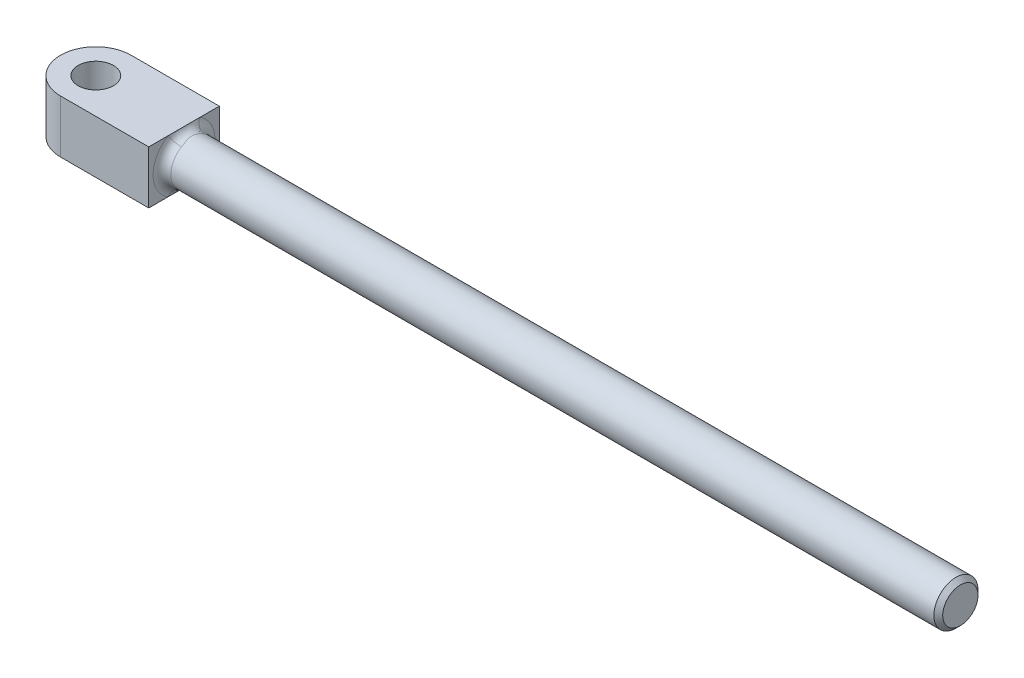
ISO-10303-21;
HEADER;
FILE_DESCRIPTION(('STEP AP214'),'2;1');
FILE_NAME('part.step','',(''),(''),'','','');
FILE_SCHEMA(('AUTOMOTIVE_DESIGN { 1 0 10303 214 1 1 1 1 }'));
ENDSEC;
DATA;
#1=APPLICATION_CONTEXT('core data for automotive mechanical design processes');
#2=APPLICATION_PROTOCOL_DEFINITION('international standard','automotive_design',2000,#1);
#3=PRODUCT_CONTEXT('',#1,'mechanical');
#4=PRODUCT('Part','Part','',(#3));
#5=PRODUCT_RELATED_PRODUCT_CATEGORY('part','',(#4));
#6=PRODUCT_DEFINITION_FORMATION('','',#4);
#7=PRODUCT_DEFINITION_CONTEXT('part definition',#1,'design');
#8=PRODUCT_DEFINITION('design','',#6,#7);
#9=PRODUCT_DEFINITION_SHAPE('','',#8);
#10=(LENGTH_UNIT() NAMED_UNIT(*) SI_UNIT(.MILLI.,.METRE.));
#11=(NAMED_UNIT(*) PLANE_ANGLE_UNIT() SI_UNIT($,.RADIAN.));
#12=(NAMED_UNIT(*) SI_UNIT($,.STERADIAN.) SOLID_ANGLE_UNIT());
#13=UNCERTAINTY_MEASURE_WITH_UNIT(LENGTH_MEASURE(1.E-05),#10,'distance_accuracy_value','');
#14=(GEOMETRIC_REPRESENTATION_CONTEXT(3) GLOBAL_UNCERTAINTY_ASSIGNED_CONTEXT((#13)) GLOBAL_UNIT_ASSIGNED_CONTEXT((#10,
#11,#12)) REPRESENTATION_CONTEXT('',''));
#15=CARTESIAN_POINT('',(0.,0.,0.));
#16=DIRECTION('',(0.,0.,1.));
#17=DIRECTION('',(1.,0.,0.));
#18=AXIS2_PLACEMENT_3D('',#15,#16,#17);
#19=CARTESIAN_POINT('',(-44.,3.,-3.99999999999999));
#20=DIRECTION('',(-1.,0.,0.));
#21=DIRECTION('',(0.,0.,1.));
#22=AXIS2_PLACEMENT_3D('',#19,#20,#21);
#23=PLANE('',#22);
#24=DIRECTION('',(0.,0.,-1.));
#25=VECTOR('',#24,1.);
#26=CARTESIAN_POINT('',(-44.,-3.,-3.99999999999999));
#27=LINE('',#26,#25);
#28=CARTESIAN_POINT('',(-44.,-3.,4.00000000000001));
#29=VERTEX_POINT('',#28);
#30=CARTESIAN_POINT('',(-44.,-3.,1.80277563773199));
#31=VERTEX_POINT('',#30);
#32=EDGE_CURVE('E252',#29,#31,#27,.T.);
#33=ORIENTED_EDGE('',*,*,#32,.T.);
#34=CARTESIAN_POINT('',(-44.,0.,0.));
#35=DIRECTION('',(-1.,0.,0.));
#36=DIRECTION('',(0.,0.,1.));
#37=AXIS2_PLACEMENT_3D('',#34,#35,#36);
#38=CIRCLE('',#37,3.5);
#39=CARTESIAN_POINT('',(-44.,3.,1.80277563773199));
#40=VERTEX_POINT('',#39);
#41=EDGE_CURVE('E69',#31,#40,#38,.T.);
#42=ORIENTED_EDGE('',*,*,#41,.T.);
#43=DIRECTION('',(0.,0.,-1.));
#44=VECTOR('',#43,1.);
#45=CARTESIAN_POINT('',(-44.,3.,-3.99999999999999));
#46=LINE('',#45,#44);
#47=CARTESIAN_POINT('',(-44.,3.,4.00000000000001));
#48=VERTEX_POINT('',#47);
#49=EDGE_CURVE('E122',#48,#40,#46,.T.);
#50=ORIENTED_EDGE('',*,*,#49,.F.);
#51=DIRECTION('',(0.,-1.,0.));
#52=VECTOR('',#51,1.);
#53=CARTESIAN_POINT('',(-44.,3.,4.00000000000001));
#54=LINE('',#53,#52);
#55=EDGE_CURVE('E254',#48,#29,#54,.T.);
#56=ORIENTED_EDGE('',*,*,#55,.T.);
#57=EDGE_LOOP('',(#33,#42,#50,#56));
#58=FACE_BOUND('',#57,.T.);
#59=ADVANCED_FACE('F45',(#58),#23,.F.);
#60=CARTESIAN_POINT('',(44.,0.,0.));
#61=DIRECTION('',(-1.,0.,0.));
#62=DIRECTION('',(0.,0.,1.));
#63=AXIS2_PLACEMENT_3D('',#60,#61,#62);
#64=CYLINDRICAL_SURFACE('',#63,2.5);
#65=CARTESIAN_POINT('',(43.5,0.,0.));
#66=DIRECTION('',(1.,0.,0.));
#67=DIRECTION('',(0.,0.,-1.));
#68=AXIS2_PLACEMENT_3D('',#65,#66,#67);
#69=CIRCLE('',#68,2.5);
#70=CARTESIAN_POINT('',(43.5,0.,-2.5));
#71=VERTEX_POINT('',#70);
#72=EDGE_CURVE('E11',#71,#71,#69,.F.);
#73=ORIENTED_EDGE('',*,*,#72,.T.);
#74=EDGE_LOOP('',(#73));
#75=FACE_BOUND('',#74,.T.);
#76=CARTESIAN_POINT('',(-43.,0.,0.));
#77=DIRECTION('',(-1.,0.,0.));
#78=DIRECTION('',(0.,0.,1.));
#79=AXIS2_PLACEMENT_3D('',#76,#77,#78);
#80=CIRCLE('',#79,2.5);
#81=CARTESIAN_POINT('',(-43.,2.14285714285714,1.28769688409428));
#82=VERTEX_POINT('',#81);
#83=CARTESIAN_POINT('',(-43.,-2.14285714285714,1.28769688409428));
#84=VERTEX_POINT('',#83);
#85=EDGE_CURVE('E138',#82,#84,#80,.F.);
#86=ORIENTED_EDGE('',*,*,#85,.T.);
#87=CARTESIAN_POINT('',(-43.089797118085,-1.84702666727615,1.68478262407076));
#88=CARTESIAN_POINT('',(-44.4013055840775,-2.11805305184009,1.38765648288614));
#89=CARTESIAN_POINT('',(-44.,-3.,2.35869567369906));
#90=CARTESIAN_POINT('',(-43.0750365677151,-1.87021882017818,1.65936827293122));
#91=CARTESIAN_POINT('',(-44.3701378909476,-2.10409965880878,1.39485788528736));
#92=CARTESIAN_POINT('',(-44.,-3.,2.32311558212301));
#93=CARTESIAN_POINT('',(-43.0624960551256,-1.8931706547633,1.63314087938531));
#94=CARTESIAN_POINT('',(-44.3378304890209,-2.09472768310196,1.39873123079868));
#95=CARTESIAN_POINT('',(-44.,-3.,2.28639723116133));
#96=CARTESIAN_POINT('',(-43.0413121648804,-1.93827997476055,1.57933264082472));
#97=CARTESIAN_POINT('',(-44.2739687568214,-2.08398106756867,1.3997411936574));
#98=CARTESIAN_POINT('',(-44.,-3.,2.21106569716945));
#99=CARTESIAN_POINT('',(-43.0326604969719,-1.96043905638494,1.55175481528735));
#100=CARTESIAN_POINT('',(-44.2424003619311,-2.08237228525282,1.39707606759514));
#101=CARTESIAN_POINT('',(-44.,-3.,2.1724567414075));
#102=CARTESIAN_POINT('',(-43.0118107698363,-2.02490711609745,1.46788389797563));
#103=CARTESIAN_POINT('',(-44.153160239198,-2.08663625544711,1.38007393620703));
#104=CARTESIAN_POINT('',(-44.,-3.,2.05503745715557));
#105=CARTESIAN_POINT('',(-43.00440526438,-2.06575259890433,1.40985814870029));
#106=CARTESIAN_POINT('',(-44.0973752365874,-2.10056168474141,1.35734706621003));
#107=CARTESIAN_POINT('',(-44.,-3.,1.97380140817703));
#108=CARTESIAN_POINT('',(-42.996699571837,-2.16653078185199,1.25280520925142));
#109=CARTESIAN_POINT('',(-43.971793247003,-2.1515106641981,1.27354998841386));
#110=CARTESIAN_POINT('',(-44.,-3.,1.75392729295749));
#111=CARTESIAN_POINT('',(-43.0038144970095,-2.22227780908099,1.15097658677616));
#112=CARTESIAN_POINT('',(-43.9094620246063,-2.19733566368004,1.19776380716157));
#113=CARTESIAN_POINT('',(-44.,-3.,1.61136722148821));
#114=CARTESIAN_POINT('',(-43.0285142350657,-2.31925618416504,0.940546919485254));
#115=CARTESIAN_POINT('',(-43.8178292510465,-2.28776397044253,1.01589565420034));
#116=CARTESIAN_POINT('',(-44.,-3.,1.31676568727775));
#117=CARTESIAN_POINT('',(-43.0461778500175,-2.36037452380379,0.831900466571035));
#118=CARTESIAN_POINT('',(-43.7862845207067,-2.3331242401296,0.909812051412252));
#119=CARTESIAN_POINT('',(-44.,-3.,1.1646606531986));
#120=CARTESIAN_POINT('',(-43.0731582535501,-2.41171212801429,0.661443155926707));
#121=CARTESIAN_POINT('',(-43.7528917245329,-2.39215410620666,0.73293320756347));
#122=CARTESIAN_POINT('',(-44.,-3.,0.926020418297847));
#123=CARTESIAN_POINT('',(-43.0825522109005,-2.4274223778965,0.601243759095351));
#124=CARTESIAN_POINT('',(-43.7439634770233,-2.41075944684108,0.66908859746001));
#125=CARTESIAN_POINT('',(-44.,-3.,0.841741262734434));
#126=CARTESIAN_POINT('',(-43.0998403341181,-2.45432605473146,0.479742938974906));
#127=CARTESIAN_POINT('',(-43.7300358645077,-2.44303860810299,0.538014598545595));
#128=CARTESIAN_POINT('',(-44.,-3.,0.671640114565432));
#129=CARTESIAN_POINT('',(-43.1077350515484,-2.46552114449967,0.418441930084296));
#130=CARTESIAN_POINT('',(-43.7249453148161,-2.45686188645873,0.470525326937772));
#131=CARTESIAN_POINT('',(-44.,-3.,0.585818702117714));
#132=CARTESIAN_POINT('',(-43.1207588796569,-2.483274322633,0.295297174727514));
#133=CARTESIAN_POINT('',(-43.7174407917484,-2.47886682684453,0.333738205015885));
#134=CARTESIAN_POINT('',(-44.,-3.,0.41341604461882));
#135=CARTESIAN_POINT('',(-43.1259001064712,-2.48985276592177,0.23345704344554));
#136=CARTESIAN_POINT('',(-43.7149720886307,-2.48717845577119,0.264142380679068));
#137=CARTESIAN_POINT('',(-44.,-3.,0.326839860825512));
#138=CARTESIAN_POINT('',(-43.1326423774325,-2.49838093998099,0.109361414969622));
#139=CARTESIAN_POINT('',(-43.7118654798941,-2.49792896303268,0.124128201815237));
#140=CARTESIAN_POINT('',(-44.,-3.,0.15310598095591));
#141=CARTESIAN_POINT('',(-43.134243770003,-2.50033112630897,0.0471059592608588));
#142=CARTESIAN_POINT('',(-43.7112114325808,-2.5004215525342,0.053369086200987));
#143=CARTESIAN_POINT('',(-44.,-3.,0.0659483429588708));
#144=CARTESIAN_POINT('',(-43.1336139067538,-2.49955575223616,-0.0809249677260376));
#145=CARTESIAN_POINT('',(-43.7114774751147,-2.4994348313836,-0.0917267287856808));
#146=CARTESIAN_POINT('',(-44.,-3.,-0.11329495480976));
#147=CARTESIAN_POINT('',(-43.1311586456095,-2.49655692159848,-0.146698507289059));
#148=CARTESIAN_POINT('',(-43.7124911460776,-2.49560052172953,-0.166438542504345));
#149=CARTESIAN_POINT('',(-44.,-3.,-0.205377910178892));
#150=CARTESIAN_POINT('',(-43.1224512074842,-2.48540146107993,-0.277672408532116));
#151=CARTESIAN_POINT('',(-43.716666788324,-2.48158959625075,-0.313859143066439));
#152=CARTESIAN_POINT('',(-44.,-3.,-0.388741371970758));
#153=CARTESIAN_POINT('',(-43.1161982583954,-2.47724378233976,-0.34287265091976));
#154=CARTESIAN_POINT('',(-43.7198536950069,-2.4713346985524,-0.38696412992512));
#155=CARTESIAN_POINT('',(-44.,-3.,-0.480021711384163));
#156=CARTESIAN_POINT('',(-43.0932464010228,-2.44504355931936,-0.537749623298509));
#157=CARTESIAN_POINT('',(-43.7342534174093,-2.4313991285767,-0.603266803000684));
#158=CARTESIAN_POINT('',(-44.,-3.,-0.752849472792696));
#159=CARTESIAN_POINT('',(-43.0723789849322,-2.4132798538366,-0.665936276663973));
#160=CARTESIAN_POINT('',(-43.7505706277765,-2.39210640783797,-0.742186068976914));
#161=CARTESIAN_POINT('',(-44.,-3.,-0.932310787375736));
#162=CARTESIAN_POINT('',(-43.0325989277867,-2.32918194316109,-0.918065057160651));
#163=CARTESIAN_POINT('',(-43.8098708915164,-2.29892237927612,-0.99519210121178));
#164=CARTESIAN_POINT('',(-44.,-3.,-1.28529107997797));
#165=CARTESIAN_POINT('',(-43.01372459553,-2.27651421506208,-1.04190105099422));
#166=CARTESIAN_POINT('',(-43.8552965844584,-2.24305314597983,-1.1102563906792));
#167=CARTESIAN_POINT('',(-44.,-3.,-1.45866147138323));
#168=CARTESIAN_POINT('',(-43.0006561131893,-2.18316948515407,-1.21991874616669));
#169=CARTESIAN_POINT('',(-43.9527001394436,-2.16884641960792,-1.2448598848791));
#170=CARTESIAN_POINT('',(-44.,-3.,-1.70788624463767));
#171=CARTESIAN_POINT('',(-42.9988115884042,-2.149871023253,-1.27769153842257));
#172=CARTESIAN_POINT('',(-43.9914812930602,-2.145083791615,-1.28423049414726));
#173=CARTESIAN_POINT('',(-44.,-3.,-1.78876815379295));
#174=CARTESIAN_POINT('',(-43.0027809524236,-2.0788450920917,-1.39025899402648));
#175=CARTESIAN_POINT('',(-44.0802128203742,-2.10631330259421,-1.34781643223735));
#176=CARTESIAN_POINT('',(-44.,-3.,-1.94636259163616));
#177=CARTESIAN_POINT('',(-43.0085821638041,-2.04112504867187,-1.445058430778));
#178=CARTESIAN_POINT('',(-44.1308276829839,-2.09160274518386,-1.37150981875896));
#179=CARTESIAN_POINT('',(-44.,-3.,-2.02308180308897));
#180=CARTESIAN_POINT('',(-43.0287135788627,-1.96987321995235,-1.54025161223537));
#181=CARTESIAN_POINT('',(-44.2293462180589,-2.08120077433799,-1.39659640419796));
#182=CARTESIAN_POINT('',(-44.,-3.,-2.1563522571297));
#183=CARTESIAN_POINT('',(-43.0411101719168,-1.93700833370554,-1.58133744408649));
#184=CARTESIAN_POINT('',(-44.2764809877482,-2.08277430752351,-1.40104255573381));
#185=CARTESIAN_POINT('',(-44.,-3.,-2.21387242172118));
#186=CARTESIAN_POINT('',(-43.0748140684746,-1.86941106524606,-1.66075648332885));
#187=CARTESIAN_POINT('',(-44.3718312861369,-2.10297416756328,-1.39609191158888));
#188=CARTESIAN_POINT('',(-44.,-3.,-2.3250590766603));
#189=CARTESIAN_POINT('',(-43.0962198088155,-1.83466186451648,-1.69905362584828));
#190=CARTESIAN_POINT('',(-44.4200246778576,-2.12254536468005,-1.38591811782259));
#191=CARTESIAN_POINT('',(-44.,-3.,-2.37867507618739));
#192=CARTESIAN_POINT('',(-43.1230308972261,-1.7996094539966,-1.73534025859082));
#193=CARTESIAN_POINT('',(-44.4637953692632,-2.1536011914318,-1.36823825990707));
#194=CARTESIAN_POINT('',(-44.,-3.,-2.42947636202715));
#195=(BOUNDED_SURFACE() B_SPLINE_SURFACE(3,2,((#87,#88,#89),(#90,#91,#92),(#93,#94,#95),(#96,
#97,#98),(#99,#100,#101),(#102,#103,#104),(#105,#106,#107),(#108,#109,#110),(#111,#112,#113),
(#114,#115,#116),(#117,#118,#119),(#120,#121,#122),(#123,#124,#125),(#126,#127,#128),(#129,#130,
#131),(#132,#133,#134),(#135,#136,#137),(#138,#139,#140),(#141,#142,#143),(#144,#145,#146),
(#147,#148,#149),(#150,#151,#152),(#153,#154,#155),(#156,#157,#158),(#159,#160,#161),(#162,#163,
#164),(#165,#166,#167),(#168,#169,#170),(#171,#172,#173),(#174,#175,#176),(#177,#178,#179),
(#180,#181,#182),(#183,#184,#185),(#186,#187,#188),(#189,#190,#191),(#192,#193,#194)),
.UNSPECIFIED.,.F.,.F.,.F.) B_SPLINE_SURFACE_WITH_KNOTS((4,2,2,2,2,2,2,2,2,2,2,2,2,2,2,2,2,4),(3,
3),(0.,0.150978452111826,0.301633503365175,0.599468504271149,1.08493079559652,1.5740658222736,
1.83667758241671,2.09919254100669,2.36054266600819,2.62186706535213,2.89810917700128,
3.17440747024342,3.73017973784789,4.29520076320605,4.57485505395894,4.85404623174447,
5.0775082098356,5.30347792971451),(0.,1.),
.UNSPECIFIED.) GEOMETRIC_REPRESENTATION_ITEM() RATIONAL_B_SPLINE_SURFACE(((1.,0.58907223863504,
1.),(1.,0.597621981679868,1.),(1.,0.60628107213765,1.),(1.,0.623622640940449,1.),(1.,
0.632305029457277,1.),(1.,0.657952795370195,1.),(1.,0.674723639585425,1.),(1.,0.716899899837879,
1.),(1.,0.74108911560171,1.),(1.,0.783806931119418,1.),(1.,0.802291321337427,1.),(1.,
0.825548340664816,1.),(1.,0.832706660558894,1.),(1.,0.845003938290569,1.),(1.,0.850143639514369,
1.),(1.,0.858307963303754,1.),(1.,0.861341869719555,1.),(1.,0.865276991795517,1.),(1.,
0.866178417354906,1.),(1.,0.865820137657809,1.),(1.,0.864434126698027,1.),(1.,0.85928990934619,
1.),(1.,0.855531220558888,1.),(1.,0.840741031559036,1.),(1.,0.826198716210334,1.),(1.,
0.788270185201534,1.),(1.,0.764740823018138,1.),(1.,0.724264523444221,1.),(1.,0.709994983454136,
1.),(1.,0.680153160391981,1.),(1.,0.664583073820695,1.),(1.,0.63597985940237,1.),(1.,
0.623060704128204,1.),(1.,0.597254296383171,1.),(1.,0.584369028951347,1.),(1.,0.571874723989392,1.))) REPRESENTATION_ITEM('') SURFACE());
#196=CARTESIAN_POINT('',(-43.089797118085,-1.84702666727615,1.68478262407076));
#197=CARTESIAN_POINT('',(-43.0750365677151,-1.87021882017818,1.65936827293122));
#198=CARTESIAN_POINT('',(-43.0624960551256,-1.8931706547633,1.63314087938531));
#199=CARTESIAN_POINT('',(-43.0413121648804,-1.93827997476055,1.57933264082472));
#200=CARTESIAN_POINT('',(-43.0326604969719,-1.96043905638494,1.55175481528735));
#201=CARTESIAN_POINT('',(-43.0118107698362,-2.02490711609745,1.46788389797563));
#202=CARTESIAN_POINT('',(-43.00440526438,-2.06575259890433,1.40985814870029));
#203=CARTESIAN_POINT('',(-42.996699571837,-2.16653078185199,1.25280520925142));
#204=CARTESIAN_POINT('',(-43.0038144970095,-2.22227780908099,1.15097658677616));
#205=CARTESIAN_POINT('',(-43.0285142350657,-2.31925618416504,0.940546919485254));
#206=CARTESIAN_POINT('',(-43.0461778500175,-2.36037452380379,0.831900466571035));
#207=CARTESIAN_POINT('',(-43.0731582535501,-2.41171212801429,0.661443155926707));
#208=CARTESIAN_POINT('',(-43.0825522109005,-2.4274223778965,0.601243759095351));
#209=CARTESIAN_POINT('',(-43.0998403341181,-2.45432605473146,0.479742938974906));
#210=CARTESIAN_POINT('',(-43.1077350515484,-2.46552114449967,0.418441930084296));
#211=CARTESIAN_POINT('',(-43.1207588796569,-2.483274322633,0.295297174727514));
#212=CARTESIAN_POINT('',(-43.1259001064712,-2.48985276592177,0.23345704344554));
#213=CARTESIAN_POINT('',(-43.1326423774325,-2.49838093998099,0.109361414969622));
#214=CARTESIAN_POINT('',(-43.134243770003,-2.50033112630897,0.0471059592608588));
#215=CARTESIAN_POINT('',(-43.1336139067538,-2.49955575223616,-0.0809249677260375));
#216=CARTESIAN_POINT('',(-43.1311586456095,-2.49655692159848,-0.146698507289059));
#217=CARTESIAN_POINT('',(-43.1224512074842,-2.48540146107993,-0.277672408532116));
#218=CARTESIAN_POINT('',(-43.1161982583954,-2.47724378233976,-0.34287265091976));
#219=CARTESIAN_POINT('',(-43.0932464010228,-2.44504355931936,-0.537749623298509));
#220=CARTESIAN_POINT('',(-43.0723789849322,-2.4132798538366,-0.665936276663973));
#221=CARTESIAN_POINT('',(-43.0325989277867,-2.32918194316109,-0.918065057160651));
#222=CARTESIAN_POINT('',(-43.01372459553,-2.27651421506208,-1.04190105099422));
#223=CARTESIAN_POINT('',(-43.0006561131893,-2.18316948515407,-1.21991874616669));
#224=CARTESIAN_POINT('',(-42.9988115884042,-2.149871023253,-1.27769153842257));
#225=CARTESIAN_POINT('',(-43.0027809524236,-2.0788450920917,-1.39025899402648));
#226=CARTESIAN_POINT('',(-43.0085821638041,-2.04112504867187,-1.445058430778));
#227=CARTESIAN_POINT('',(-43.0287135788627,-1.96987321995235,-1.54025161223537));
#228=CARTESIAN_POINT('',(-43.0411101719168,-1.93700833370554,-1.58133744408649));
#229=CARTESIAN_POINT('',(-43.0748140684746,-1.86941106524606,-1.66075648332885));
#230=CARTESIAN_POINT('',(-43.0962198088155,-1.83466186451648,-1.69905362584828));
#231=CARTESIAN_POINT('',(-43.1230308972261,-1.7996094539966,-1.73534025859082));
#232=B_SPLINE_CURVE_WITH_KNOTS('',3,(#196,#197,#198,#199,#200,#201,#202,#203,#204,#205,#206,
#207,#208,#209,#210,#211,#212,#213,#214,#215,#216,#217,#218,#219,#220,#221,#222,#223,#224,#225,
#226,#227,#228,#229,#230,#231),.UNSPECIFIED.,.F.,.F.,(4,2,2,2,2,2,2,2,2,2,2,2,2,2,2,2,2,4),(0.,
0.150978452111826,0.301633503365175,0.599468504271149,1.08493079559652,1.5740658222736,
1.83667758241671,2.09919254100669,2.36054266600819,2.62186706535213,2.89810917700128,
3.17440747024342,3.73017973784789,4.29520076320605,4.57485505395894,4.85404623174447,
5.0775082098356,5.30347792971451),.UNSPECIFIED.);
#233=CARTESIAN_POINT('',(-43.,-2.14285714285714,-1.28769688409428));
#234=VERTEX_POINT('',#233);
#235=EDGE_CURVE('E198',#84,#234,#232,.T.);
#236=ORIENTED_EDGE('',*,*,#235,.T.);
#237=CARTESIAN_POINT('',(-43.,0.,0.));
#238=DIRECTION('',(-1.,0.,0.));
#239=DIRECTION('',(0.,0.,1.));
#240=AXIS2_PLACEMENT_3D('',#237,#238,#239);
#241=CIRCLE('',#240,2.5);
#242=CARTESIAN_POINT('',(-43.,2.14285714285714,-1.28769688409428));
#243=VERTEX_POINT('',#242);
#244=EDGE_CURVE('E156',#234,#243,#241,.F.);
#245=ORIENTED_EDGE('',*,*,#244,.T.);
#246=CARTESIAN_POINT('',(-43.089797118085,1.84702666727615,-1.68478262407076));
#247=CARTESIAN_POINT('',(-44.4013055840775,2.11805305184009,-1.38765648288614));
#248=CARTESIAN_POINT('',(-44.,3.,-2.35869567369906));
#249=CARTESIAN_POINT('',(-43.0750365677151,1.87021882017818,-1.65936827293122));
#250=CARTESIAN_POINT('',(-44.3701378909476,2.10409965880878,-1.39485788528736));
#251=CARTESIAN_POINT('',(-44.,3.,-2.32311558212301));
#252=CARTESIAN_POINT('',(-43.0624960551256,1.8931706547633,-1.63314087938531));
#253=CARTESIAN_POINT('',(-44.3378304890209,2.09472768310196,-1.39873123079867));
#254=CARTESIAN_POINT('',(-44.,3.,-2.28639723116133));
#255=CARTESIAN_POINT('',(-43.0413121648804,1.93827997476055,-1.57933264082472));
#256=CARTESIAN_POINT('',(-44.2739687568214,2.08398106756867,-1.39974119365739));
#257=CARTESIAN_POINT('',(-44.,3.,-2.21106569716945));
#258=CARTESIAN_POINT('',(-43.0326604969719,1.96043905638494,-1.55175481528735));
#259=CARTESIAN_POINT('',(-44.2424003619311,2.08237228525282,-1.39707606759514));
#260=CARTESIAN_POINT('',(-44.,3.,-2.1724567414075));
#261=CARTESIAN_POINT('',(-43.0118107698363,2.02490711609745,-1.46788389797563));
#262=CARTESIAN_POINT('',(-44.153160239198,2.08663625544711,-1.38007393620703));
#263=CARTESIAN_POINT('',(-44.,3.,-2.05503745715557));
#264=CARTESIAN_POINT('',(-43.00440526438,2.06575259890433,-1.40985814870029));
#265=CARTESIAN_POINT('',(-44.0973752365874,2.10056168474141,-1.35734706621003));
#266=CARTESIAN_POINT('',(-44.,3.,-1.97380140817703));
#267=CARTESIAN_POINT('',(-42.996699571837,2.16653078185199,-1.25280520925142));
#268=CARTESIAN_POINT('',(-43.971793247003,2.1515106641981,-1.27354998841386));
#269=CARTESIAN_POINT('',(-44.,3.,-1.75392729295749));
#270=CARTESIAN_POINT('',(-43.0038144970095,2.22227780908099,-1.15097658677616));
#271=CARTESIAN_POINT('',(-43.9094620246063,2.19733566368004,-1.19776380716157));
#272=CARTESIAN_POINT('',(-44.,3.,-1.61136722148821));
#273=CARTESIAN_POINT('',(-43.0285142350657,2.31925618416504,-0.940546919485254));
#274=CARTESIAN_POINT('',(-43.8178292510465,2.28776397044253,-1.01589565420034));
#275=CARTESIAN_POINT('',(-44.,3.,-1.31676568727775));
#276=CARTESIAN_POINT('',(-43.0461778500175,2.36037452380379,-0.831900466571035));
#277=CARTESIAN_POINT('',(-43.7862845207067,2.3331242401296,-0.909812051412252));
#278=CARTESIAN_POINT('',(-44.,3.,-1.1646606531986));
#279=CARTESIAN_POINT('',(-43.0731582535501,2.41171212801429,-0.661443155926707));
#280=CARTESIAN_POINT('',(-43.7528917245329,2.39215410620666,-0.73293320756347));
#281=CARTESIAN_POINT('',(-44.,3.,-0.926020418297847));
#282=CARTESIAN_POINT('',(-43.0825522109005,2.4274223778965,-0.601243759095351));
#283=CARTESIAN_POINT('',(-43.7439634770233,2.41075944684108,-0.66908859746001));
#284=CARTESIAN_POINT('',(-44.,3.,-0.841741262734434));
#285=CARTESIAN_POINT('',(-43.0998403341181,2.45432605473146,-0.479742938974906));
#286=CARTESIAN_POINT('',(-43.7300358645077,2.44303860810299,-0.538014598545595));
#287=CARTESIAN_POINT('',(-44.,3.,-0.671640114565432));
#288=CARTESIAN_POINT('',(-43.1077350515484,2.46552114449967,-0.418441930084296));
#289=CARTESIAN_POINT('',(-43.7249453148161,2.45686188645873,-0.470525326937772));
#290=CARTESIAN_POINT('',(-44.,3.,-0.585818702117714));
#291=CARTESIAN_POINT('',(-43.1207588796569,2.483274322633,-0.295297174727514));
#292=CARTESIAN_POINT('',(-43.7174407917484,2.47886682684453,-0.333738205015885));
#293=CARTESIAN_POINT('',(-44.,3.,-0.41341604461882));
#294=CARTESIAN_POINT('',(-43.1259001064712,2.48985276592177,-0.23345704344554));
#295=CARTESIAN_POINT('',(-43.7149720886307,2.48717845577119,-0.264142380679068));
#296=CARTESIAN_POINT('',(-44.,3.,-0.326839860825512));
#297=CARTESIAN_POINT('',(-43.1326423774325,2.49838093998099,-0.109361414969622));
#298=CARTESIAN_POINT('',(-43.7118654798941,2.49792896303268,-0.124128201815237));
#299=CARTESIAN_POINT('',(-44.,3.,-0.15310598095591));
#300=CARTESIAN_POINT('',(-43.134243770003,2.50033112630897,-0.0471059592608588));
#301=CARTESIAN_POINT('',(-43.7112114325808,2.5004215525342,-0.053369086200987));
#302=CARTESIAN_POINT('',(-44.,3.,-0.0659483429588708));
#303=CARTESIAN_POINT('',(-43.1336139067538,2.49955575223616,0.0809249677260376));
#304=CARTESIAN_POINT('',(-43.7114774751147,2.4994348313836,0.0917267287856808));
#305=CARTESIAN_POINT('',(-44.,3.,0.11329495480976));
#306=CARTESIAN_POINT('',(-43.1311586456095,2.49655692159848,0.146698507289059));
#307=CARTESIAN_POINT('',(-43.7124911460776,2.49560052172953,0.166438542504345));
#308=CARTESIAN_POINT('',(-44.,3.,0.205377910178892));
#309=CARTESIAN_POINT('',(-43.1224512074842,2.48540146107993,0.277672408532116));
#310=CARTESIAN_POINT('',(-43.716666788324,2.48158959625075,0.313859143066439));
#311=CARTESIAN_POINT('',(-44.,3.,0.388741371970758));
#312=CARTESIAN_POINT('',(-43.1161982583954,2.47724378233976,0.34287265091976));
#313=CARTESIAN_POINT('',(-43.7198536950069,2.4713346985524,0.38696412992512));
#314=CARTESIAN_POINT('',(-44.,3.,0.480021711384163));
#315=CARTESIAN_POINT('',(-43.0932464010228,2.44504355931936,0.537749623298509));
#316=CARTESIAN_POINT('',(-43.7342534174093,2.4313991285767,0.603266803000684));
#317=CARTESIAN_POINT('',(-44.,3.,0.752849472792696));
#318=CARTESIAN_POINT('',(-43.0723789849322,2.4132798538366,0.665936276663973));
#319=CARTESIAN_POINT('',(-43.7505706277765,2.39210640783797,0.742186068976914));
#320=CARTESIAN_POINT('',(-44.,3.,0.932310787375736));
#321=CARTESIAN_POINT('',(-43.0325989277867,2.32918194316109,0.918065057160651));
#322=CARTESIAN_POINT('',(-43.8098708915164,2.29892237927612,0.99519210121178));
#323=CARTESIAN_POINT('',(-44.,3.,1.28529107997797));
#324=CARTESIAN_POINT('',(-43.01372459553,2.27651421506208,1.04190105099422));
#325=CARTESIAN_POINT('',(-43.8552965844584,2.24305314597983,1.1102563906792));
#326=CARTESIAN_POINT('',(-44.,3.,1.45866147138323));
#327=CARTESIAN_POINT('',(-43.0006561131893,2.18316948515407,1.21991874616669));
#328=CARTESIAN_POINT('',(-43.9527001394436,2.16884641960792,1.2448598848791));
#329=CARTESIAN_POINT('',(-44.,3.,1.70788624463767));
#330=CARTESIAN_POINT('',(-42.9988115884042,2.149871023253,1.27769153842257));
#331=CARTESIAN_POINT('',(-43.9914812930602,2.145083791615,1.28423049414726));
#332=CARTESIAN_POINT('',(-44.,3.,1.78876815379295));
#333=CARTESIAN_POINT('',(-43.0027809524236,2.0788450920917,1.39025899402648));
#334=CARTESIAN_POINT('',(-44.0802128203742,2.10631330259421,1.34781643223736));
#335=CARTESIAN_POINT('',(-44.,3.,1.94636259163616));
#336=CARTESIAN_POINT('',(-43.0085821638041,2.04112504867187,1.445058430778));
#337=CARTESIAN_POINT('',(-44.1308276829839,2.09160274518386,1.37150981875896));
#338=CARTESIAN_POINT('',(-44.,3.,2.02308180308897));
#339=CARTESIAN_POINT('',(-43.0287135788627,1.96987321995235,1.54025161223537));
#340=CARTESIAN_POINT('',(-44.2293462180589,2.08120077433799,1.39659640419796));
#341=CARTESIAN_POINT('',(-44.,3.,2.1563522571297));
#342=CARTESIAN_POINT('',(-43.0411101719168,1.93700833370554,1.58133744408649));
#343=CARTESIAN_POINT('',(-44.2764809877482,2.08277430752351,1.40104255573381));
#344=CARTESIAN_POINT('',(-44.,3.,2.21387242172117));
#345=CARTESIAN_POINT('',(-43.0748140684746,1.86941106524606,1.66075648332885));
#346=CARTESIAN_POINT('',(-44.3718312861369,2.10297416756328,1.39609191158888));
#347=CARTESIAN_POINT('',(-44.,3.,2.3250590766603));
#348=CARTESIAN_POINT('',(-43.0962198088155,1.83466186451648,1.69905362584828));
#349=CARTESIAN_POINT('',(-44.4200246778576,2.12254536468005,1.38591811782259));
#350=CARTESIAN_POINT('',(-44.,3.,2.37867507618739));
#351=CARTESIAN_POINT('',(-43.1230308972261,1.7996094539966,1.73534025859082));
#352=CARTESIAN_POINT('',(-44.4637953692632,2.1536011914318,1.36823825990707));
#353=CARTESIAN_POINT('',(-44.,3.,2.42947636202715));
#354=(BOUNDED_SURFACE() B_SPLINE_SURFACE(3,2,((#246,#247,#248),(#249,#250,#251),(#252,#253,
#254),(#255,#256,#257),(#258,#259,#260),(#261,#262,#263),(#264,#265,#266),(#267,#268,#269),
(#270,#271,#272),(#273,#274,#275),(#276,#277,#278),(#279,#280,#281),(#282,#283,#284),(#285,#286,
#287),(#288,#289,#290),(#291,#292,#293),(#294,#295,#296),(#297,#298,#299),(#300,#301,#302),
(#303,#304,#305),(#306,#307,#308),(#309,#310,#311),(#312,#313,#314),(#315,#316,#317),(#318,#319,
#320),(#321,#322,#323),(#324,#325,#326),(#327,#328,#329),(#330,#331,#332),(#333,#334,#335),
(#336,#337,#338),(#339,#340,#341),(#342,#343,#344),(#345,#346,#347),(#348,#349,#350),(#351,#352,
#353)),.UNSPECIFIED.,.F.,.F.,.F.) B_SPLINE_SURFACE_WITH_KNOTS((4,2,2,2,2,2,2,2,2,2,2,2,2,2,2,2,
2,4),(3,3),(0.,0.150978452111826,0.301633503365175,0.599468504271149,1.08493079559652,
1.5740658222736,1.83667758241671,2.09919254100669,2.36054266600819,2.62186706535213,
2.89810917700128,3.17440747024342,3.73017973784789,4.29520076320605,4.57485505395894,
4.85404623174447,5.0775082098356,5.30347792971451),(0.,1.),
.UNSPECIFIED.) GEOMETRIC_REPRESENTATION_ITEM() RATIONAL_B_SPLINE_SURFACE(((1.,0.58907223863504,
1.),(1.,0.597621981679868,1.),(1.,0.60628107213765,1.),(1.,0.62362264094045,1.),(1.,
0.632305029457277,1.),(1.,0.657952795370195,1.),(1.,0.674723639585425,1.),(1.,0.716899899837879,
1.),(1.,0.74108911560171,1.),(1.,0.783806931119418,1.),(1.,0.802291321337427,1.),(1.,
0.825548340664816,1.),(1.,0.832706660558894,1.),(1.,0.845003938290569,1.),(1.,0.850143639514369,
1.),(1.,0.858307963303754,1.),(1.,0.861341869719555,1.),(1.,0.865276991795517,1.),(1.,
0.866178417354906,1.),(1.,0.865820137657809,1.),(1.,0.864434126698027,1.),(1.,0.85928990934619,
1.),(1.,0.855531220558888,1.),(1.,0.840741031559036,1.),(1.,0.826198716210334,1.),(1.,
0.788270185201534,1.),(1.,0.764740823018138,1.),(1.,0.724264523444221,1.),(1.,0.709994983454136,
1.),(1.,0.680153160391981,1.),(1.,0.664583073820695,1.),(1.,0.635979859402369,1.),(1.,
0.623060704128204,1.),(1.,0.597254296383171,1.),(1.,0.584369028951347,1.),(1.,0.571874723989392,1.))) REPRESENTATION_ITEM('') SURFACE());
#355=CARTESIAN_POINT('',(-43.089797118085,1.84702666727615,-1.68478262407076));
#356=CARTESIAN_POINT('',(-43.0750365677151,1.87021882017818,-1.65936827293122));
#357=CARTESIAN_POINT('',(-43.0624960551256,1.8931706547633,-1.63314087938531));
#358=CARTESIAN_POINT('',(-43.0413121648804,1.93827997476055,-1.57933264082472));
#359=CARTESIAN_POINT('',(-43.0326604969719,1.96043905638494,-1.55175481528735));
#360=CARTESIAN_POINT('',(-43.0118107698362,2.02490711609745,-1.46788389797563));
#361=CARTESIAN_POINT('',(-43.00440526438,2.06575259890433,-1.40985814870029));
#362=CARTESIAN_POINT('',(-42.996699571837,2.16653078185199,-1.25280520925142));
#363=CARTESIAN_POINT('',(-43.0038144970095,2.22227780908099,-1.15097658677616));
#364=CARTESIAN_POINT('',(-43.0285142350657,2.31925618416504,-0.940546919485254));
#365=CARTESIAN_POINT('',(-43.0461778500175,2.36037452380379,-0.831900466571035));
#366=CARTESIAN_POINT('',(-43.0731582535501,2.41171212801429,-0.661443155926707));
#367=CARTESIAN_POINT('',(-43.0825522109005,2.4274223778965,-0.601243759095351));
#368=CARTESIAN_POINT('',(-43.0998403341181,2.45432605473146,-0.479742938974906));
#369=CARTESIAN_POINT('',(-43.1077350515484,2.46552114449967,-0.418441930084296));
#370=CARTESIAN_POINT('',(-43.1207588796569,2.483274322633,-0.295297174727514));
#371=CARTESIAN_POINT('',(-43.1259001064712,2.48985276592177,-0.23345704344554));
#372=CARTESIAN_POINT('',(-43.1326423774325,2.49838093998099,-0.109361414969622));
#373=CARTESIAN_POINT('',(-43.134243770003,2.50033112630897,-0.0471059592608588));
#374=CARTESIAN_POINT('',(-43.1336139067538,2.49955575223616,0.0809249677260375));
#375=CARTESIAN_POINT('',(-43.1311586456095,2.49655692159848,0.146698507289059));
#376=CARTESIAN_POINT('',(-43.1224512074842,2.48540146107993,0.277672408532116));
#377=CARTESIAN_POINT('',(-43.1161982583954,2.47724378233976,0.34287265091976));
#378=CARTESIAN_POINT('',(-43.0932464010228,2.44504355931936,0.537749623298509));
#379=CARTESIAN_POINT('',(-43.0723789849322,2.4132798538366,0.665936276663973));
#380=CARTESIAN_POINT('',(-43.0325989277867,2.32918194316109,0.918065057160651));
#381=CARTESIAN_POINT('',(-43.01372459553,2.27651421506208,1.04190105099422));
#382=CARTESIAN_POINT('',(-43.0006561131893,2.18316948515407,1.21991874616669));
#383=CARTESIAN_POINT('',(-42.9988115884042,2.149871023253,1.27769153842257));
#384=CARTESIAN_POINT('',(-43.0027809524236,2.0788450920917,1.39025899402648));
#385=CARTESIAN_POINT('',(-43.0085821638041,2.04112504867187,1.445058430778));
#386=CARTESIAN_POINT('',(-43.0287135788627,1.96987321995235,1.54025161223537));
#387=CARTESIAN_POINT('',(-43.0411101719168,1.93700833370554,1.58133744408649));
#388=CARTESIAN_POINT('',(-43.0748140684746,1.86941106524606,1.66075648332885));
#389=CARTESIAN_POINT('',(-43.0962198088155,1.83466186451648,1.69905362584828));
#390=CARTESIAN_POINT('',(-43.1230308972261,1.7996094539966,1.73534025859082));
#391=B_SPLINE_CURVE_WITH_KNOTS('',3,(#355,#356,#357,#358,#359,#360,#361,#362,#363,#364,#365,
#366,#367,#368,#369,#370,#371,#372,#373,#374,#375,#376,#377,#378,#379,#380,#381,#382,#383,#384,
#385,#386,#387,#388,#389,#390),.UNSPECIFIED.,.F.,.F.,(4,2,2,2,2,2,2,2,2,2,2,2,2,2,2,2,2,4),(0.,
0.150978452111826,0.301633503365175,0.599468504271149,1.08493079559652,1.5740658222736,
1.83667758241671,2.09919254100669,2.36054266600819,2.62186706535213,2.89810917700128,
3.17440747024342,3.73017973784789,4.29520076320605,4.57485505395894,4.85404623174447,
5.0775082098356,5.30347792971451),.UNSPECIFIED.);
#392=EDGE_CURVE('E142',#243,#82,#391,.T.);
#393=ORIENTED_EDGE('',*,*,#392,.T.);
#394=EDGE_LOOP('',(#86,#236,#245,#393));
#395=FACE_BOUND('',#394,.T.);
#396=ADVANCED_FACE('F158',(#75,#395),#64,.T.);
#397=CARTESIAN_POINT('',(44.,0.,0.));
#398=DIRECTION('',(1.,0.,0.));
#399=DIRECTION('',(0.,0.,-1.));
#400=AXIS2_PLACEMENT_3D('',#397,#398,#399);
#401=PLANE('',#400);
#402=CARTESIAN_POINT('',(44.,0.,0.));
#403=DIRECTION('',(1.,0.,0.));
#404=DIRECTION('',(0.,0.,-1.));
#405=AXIS2_PLACEMENT_3D('',#402,#403,#404);
#406=CIRCLE('',#405,2.);
#407=CARTESIAN_POINT('',(44.,0.,-2.));
#408=VERTEX_POINT('',#407);
#409=EDGE_CURVE('E54',#408,#408,#406,.T.);
#410=ORIENTED_EDGE('',*,*,#409,.T.);
#411=EDGE_LOOP('',(#410));
#412=FACE_BOUND('',#411,.T.);
#413=ADVANCED_FACE('F248',(#412),#401,.T.);
#414=CARTESIAN_POINT('',(-54.,3.,0.));
#415=DIRECTION('',(0.,1.,0.));
#416=DIRECTION('',(0.,0.,1.));
#417=AXIS2_PLACEMENT_3D('',#414,#415,#416);
#418=PLANE('',#417);
#419=ORIENTED_EDGE('',*,*,#49,.T.);
#420=CARTESIAN_POINT('',(-44.,3.,-1.80277563773199));
#421=VERTEX_POINT('',#420);
#422=EDGE_CURVE('E117',#40,#421,#46,.T.);
#423=ORIENTED_EDGE('',*,*,#422,.T.);
#424=CARTESIAN_POINT('',(-44.,3.,-3.99999999999999));
#425=VERTEX_POINT('',#424);
#426=EDGE_CURVE('E61',#421,#425,#46,.T.);
#427=ORIENTED_EDGE('',*,*,#426,.T.);
#428=DIRECTION('',(-1.,0.,0.));
#429=VECTOR('',#428,1.);
#430=CARTESIAN_POINT('',(-44.,3.,-3.99999999999999));
#431=LINE('',#430,#429);
#432=CARTESIAN_POINT('',(-54.,3.,-3.99999999999999));
#433=VERTEX_POINT('',#432);
#434=EDGE_CURVE('E114',#425,#433,#431,.T.);
#435=ORIENTED_EDGE('',*,*,#434,.T.);
#436=CARTESIAN_POINT('',(-54.,3.,0.));
#437=DIRECTION('',(0.,1.,0.));
#438=DIRECTION('',(0.,0.,1.));
#439=AXIS2_PLACEMENT_3D('',#436,#437,#438);
#440=CIRCLE('',#439,4.);
#441=CARTESIAN_POINT('',(-54.,3.,4.00000000000001));
#442=VERTEX_POINT('',#441);
#443=EDGE_CURVE('E131',#433,#442,#440,.T.);
#444=ORIENTED_EDGE('',*,*,#443,.T.);
#445=DIRECTION('',(1.,0.,0.));
#446=VECTOR('',#445,1.);
#447=CARTESIAN_POINT('',(-44.,3.,4.00000000000001));
#448=LINE('',#447,#446);
#449=EDGE_CURVE('E282',#442,#48,#448,.T.);
#450=ORIENTED_EDGE('',*,*,#449,.T.);
#451=EDGE_LOOP('',(#419,#423,#427,#435,#444,#450));
#452=FACE_BOUND('',#451,.T.);
#453=CARTESIAN_POINT('',(-54.,3.,0.));
#454=DIRECTION('',(0.,1.,0.));
#455=DIRECTION('',(0.,0.,1.));
#456=AXIS2_PLACEMENT_3D('',#453,#454,#455);
#457=CIRCLE('',#456,2.);
#458=CARTESIAN_POINT('',(-54.,3.,2.00000000000001));
#459=VERTEX_POINT('',#458);
#460=EDGE_CURVE('E268',#459,#459,#457,.T.);
#461=ORIENTED_EDGE('',*,*,#460,.F.);
#462=EDGE_LOOP('',(#461));
#463=FACE_BOUND('',#462,.T.);
#464=ADVANCED_FACE('F112',(#452,#463),#418,.T.);
#465=CARTESIAN_POINT('',(-54.,-3.,0.));
#466=DIRECTION('',(0.,1.,0.));
#467=DIRECTION('',(0.,0.,1.));
#468=AXIS2_PLACEMENT_3D('',#465,#466,#467);
#469=PLANE('',#468);
#470=ORIENTED_EDGE('',*,*,#32,.F.);
#471=DIRECTION('',(1.,0.,0.));
#472=VECTOR('',#471,1.);
#473=CARTESIAN_POINT('',(-44.,-3.,4.00000000000001));
#474=LINE('',#473,#472);
#475=CARTESIAN_POINT('',(-54.,-3.,4.00000000000001));
#476=VERTEX_POINT('',#475);
#477=EDGE_CURVE('E120',#476,#29,#474,.T.);
#478=ORIENTED_EDGE('',*,*,#477,.F.);
#479=CARTESIAN_POINT('',(-54.,-3.,0.));
#480=DIRECTION('',(0.,1.,0.));
#481=DIRECTION('',(0.,0.,1.));
#482=AXIS2_PLACEMENT_3D('',#479,#480,#481);
#483=CIRCLE('',#482,4.);
#484=CARTESIAN_POINT('',(-54.,-3.,-3.99999999999999));
#485=VERTEX_POINT('',#484);
#486=EDGE_CURVE('E263',#485,#476,#483,.T.);
#487=ORIENTED_EDGE('',*,*,#486,.F.);
#488=DIRECTION('',(-1.,0.,0.));
#489=VECTOR('',#488,1.);
#490=CARTESIAN_POINT('',(-44.,-3.,-3.99999999999999));
#491=LINE('',#490,#489);
#492=CARTESIAN_POINT('',(-44.,-3.,-3.99999999999999));
#493=VERTEX_POINT('',#492);
#494=EDGE_CURVE('E258',#493,#485,#491,.T.);
#495=ORIENTED_EDGE('',*,*,#494,.F.);
#496=CARTESIAN_POINT('',(-44.,-3.,-1.80277563773199));
#497=VERTEX_POINT('',#496);
#498=EDGE_CURVE('E135',#497,#493,#27,.T.);
#499=ORIENTED_EDGE('',*,*,#498,.F.);
#500=EDGE_CURVE('E259',#31,#497,#27,.T.);
#501=ORIENTED_EDGE('',*,*,#500,.F.);
#502=EDGE_LOOP('',(#470,#478,#487,#495,#499,#501));
#503=FACE_BOUND('',#502,.T.);
#504=CARTESIAN_POINT('',(-54.,-3.,0.));
#505=DIRECTION('',(0.,1.,0.));
#506=DIRECTION('',(0.,0.,1.));
#507=AXIS2_PLACEMENT_3D('',#504,#505,#506);
#508=CIRCLE('',#507,2.);
#509=CARTESIAN_POINT('',(-54.,-3.,2.00000000000001));
#510=VERTEX_POINT('',#509);
#511=EDGE_CURVE('E271',#510,#510,#508,.T.);
#512=ORIENTED_EDGE('',*,*,#511,.T.);
#513=EDGE_LOOP('',(#512));
#514=FACE_BOUND('',#513,.T.);
#515=ADVANCED_FACE('F226',(#503,#514),#469,.F.);
#516=ORIENTED_EDGE('',*,*,#426,.F.);
#517=CARTESIAN_POINT('',(-44.,0.,0.));
#518=DIRECTION('',(-1.,0.,0.));
#519=DIRECTION('',(0.,0.,1.));
#520=AXIS2_PLACEMENT_3D('',#517,#518,#519);
#521=CIRCLE('',#520,3.5);
#522=EDGE_CURVE('E195',#421,#497,#521,.T.);
#523=ORIENTED_EDGE('',*,*,#522,.T.);
#524=ORIENTED_EDGE('',*,*,#498,.T.);
#525=DIRECTION('',(0.,-1.,0.));
#526=VECTOR('',#525,1.);
#527=CARTESIAN_POINT('',(-44.,3.,-3.99999999999999));
#528=LINE('',#527,#526);
#529=EDGE_CURVE('E126',#425,#493,#528,.T.);
#530=ORIENTED_EDGE('',*,*,#529,.F.);
#531=EDGE_LOOP('',(#516,#523,#524,#530));
#532=FACE_BOUND('',#531,.T.);
#533=ADVANCED_FACE('F133',(#532),#23,.F.);
#534=CARTESIAN_POINT('',(-44.,3.,-3.99999999999999));
#535=DIRECTION('',(0.,0.,1.));
#536=DIRECTION('',(1.,0.,0.));
#537=AXIS2_PLACEMENT_3D('',#534,#535,#536);
#538=PLANE('',#537);
#539=ORIENTED_EDGE('',*,*,#494,.T.);
#540=DIRECTION('',(0.,-1.,0.));
#541=VECTOR('',#540,1.);
#542=CARTESIAN_POINT('',(-54.,3.,-3.99999999999999));
#543=LINE('',#542,#541);
#544=EDGE_CURVE('E128',#433,#485,#543,.T.);
#545=ORIENTED_EDGE('',*,*,#544,.F.);
#546=ORIENTED_EDGE('',*,*,#434,.F.);
#547=ORIENTED_EDGE('',*,*,#529,.T.);
#548=EDGE_LOOP('',(#539,#545,#546,#547));
#549=FACE_BOUND('',#548,.T.);
#550=ADVANCED_FACE('F125',(#549),#538,.F.);
#551=CARTESIAN_POINT('',(-54.,3.,0.));
#552=DIRECTION('',(0.,-1.,0.));
#553=DIRECTION('',(0.,0.,-1.));
#554=AXIS2_PLACEMENT_3D('',#551,#552,#553);
#555=CYLINDRICAL_SURFACE('',#554,4.);
#556=ORIENTED_EDGE('',*,*,#486,.T.);
#557=DIRECTION('',(0.,-1.,0.));
#558=VECTOR('',#557,1.);
#559=CARTESIAN_POINT('',(-54.,3.,4.00000000000001));
#560=LINE('',#559,#558);
#561=EDGE_CURVE('E144',#442,#476,#560,.T.);
#562=ORIENTED_EDGE('',*,*,#561,.F.);
#563=ORIENTED_EDGE('',*,*,#443,.F.);
#564=ORIENTED_EDGE('',*,*,#544,.T.);
#565=EDGE_LOOP('',(#556,#562,#563,#564));
#566=FACE_BOUND('',#565,.T.);
#567=ADVANCED_FACE('F236',(#566),#555,.T.);
#568=CARTESIAN_POINT('',(-44.,3.,4.00000000000001));
#569=DIRECTION('',(0.,0.,-1.));
#570=DIRECTION('',(-1.,0.,0.));
#571=AXIS2_PLACEMENT_3D('',#568,#569,#570);
#572=PLANE('',#571);
#573=ORIENTED_EDGE('',*,*,#477,.T.);
#574=ORIENTED_EDGE('',*,*,#55,.F.);
#575=ORIENTED_EDGE('',*,*,#449,.F.);
#576=ORIENTED_EDGE('',*,*,#561,.T.);
#577=EDGE_LOOP('',(#573,#574,#575,#576));
#578=FACE_BOUND('',#577,.T.);
#579=ADVANCED_FACE('F233',(#578),#572,.F.);
#580=CARTESIAN_POINT('',(-54.,3.,0.));
#581=DIRECTION('',(0.,-1.,0.));
#582=DIRECTION('',(0.,0.,-1.));
#583=AXIS2_PLACEMENT_3D('',#580,#581,#582);
#584=CYLINDRICAL_SURFACE('',#583,2.);
#585=ORIENTED_EDGE('',*,*,#460,.T.);
#586=EDGE_LOOP('',(#585));
#587=FACE_BOUND('',#586,.T.);
#588=ORIENTED_EDGE('',*,*,#511,.F.);
#589=EDGE_LOOP('',(#588));
#590=FACE_BOUND('',#589,.T.);
#591=ADVANCED_FACE('F173',(#587,#590),#584,.F.);
#592=CARTESIAN_POINT('',(-43.,3.,-1.80277563773199));
#593=DIRECTION('',(0.,-0.515078753637713,-0.857142857142857));
#594=DIRECTION('',(0.,0.857142857142857,-0.515078753637713));
#595=AXIS2_PLACEMENT_3D('',#592,#593,#594);
#596=CIRCLE('',#595,1.);
#597=EDGE_CURVE('E207',#421,#243,#596,.F.);
#598=ORIENTED_EDGE('',*,*,#597,.F.);
#599=ORIENTED_EDGE('',*,*,#422,.F.);
#600=CARTESIAN_POINT('',(-43.,3.00000000000052,1.80277563773113));
#601=DIRECTION('',(-2.68055761773535E-13,0.515078753637465,-0.857142857143006));
#602=DIRECTION('',(0.,0.857142857143006,0.515078753637465));
#603=AXIS2_PLACEMENT_3D('',#600,#601,#602);
#604=CIRCLE('',#603,1.);
#605=EDGE_CURVE('E277',#82,#40,#604,.T.);
#606=ORIENTED_EDGE('',*,*,#605,.F.);
#607=ORIENTED_EDGE('',*,*,#392,.F.);
#608=EDGE_LOOP('',(#598,#599,#606,#607));
#609=FACE_BOUND('',#608,.T.);
#610=ADVANCED_FACE('F166',(#609),#354,.F.);
#611=CARTESIAN_POINT('',(-43.,0.,0.));
#612=DIRECTION('',(-1.,0.,0.));
#613=DIRECTION('',(0.,0.,1.));
#614=AXIS2_PLACEMENT_3D('',#611,#612,#613);
#615=TOROIDAL_SURFACE('',#614,3.5,1.);
#616=ORIENTED_EDGE('',*,*,#605,.T.);
#617=ORIENTED_EDGE('',*,*,#41,.F.);
#618=CARTESIAN_POINT('',(-43.,-3.,1.80277563773199));
#619=DIRECTION('',(0.,0.515078753637712,0.857142857142857));
#620=DIRECTION('',(0.,-0.857142857142857,0.515078753637713));
#621=AXIS2_PLACEMENT_3D('',#618,#619,#620);
#622=CIRCLE('',#621,1.);
#623=EDGE_CURVE('E204',#84,#31,#622,.T.);
#624=ORIENTED_EDGE('',*,*,#623,.F.);
#625=ORIENTED_EDGE('',*,*,#85,.F.);
#626=EDGE_LOOP('',(#616,#617,#624,#625));
#627=FACE_BOUND('',#626,.T.);
#628=ADVANCED_FACE('F172',(#627),#615,.F.);
#629=CARTESIAN_POINT('',(-43.,0.,0.));
#630=DIRECTION('',(-1.,0.,0.));
#631=DIRECTION('',(0.,0.,1.));
#632=AXIS2_PLACEMENT_3D('',#629,#630,#631);
#633=TOROIDAL_SURFACE('',#632,3.5,1.);
#634=ORIENTED_EDGE('',*,*,#597,.T.);
#635=ORIENTED_EDGE('',*,*,#244,.F.);
#636=CARTESIAN_POINT('',(-43.,-3.,-1.80277563773199));
#637=DIRECTION('',(0.,0.515078753637712,-0.857142857142857));
#638=DIRECTION('',(0.,0.857142857142857,0.515078753637713));
#639=AXIS2_PLACEMENT_3D('',#636,#637,#638);
#640=CIRCLE('',#639,1.);
#641=EDGE_CURVE('E201',#497,#234,#640,.T.);
#642=ORIENTED_EDGE('',*,*,#641,.F.);
#643=ORIENTED_EDGE('',*,*,#522,.F.);
#644=EDGE_LOOP('',(#634,#635,#642,#643));
#645=FACE_BOUND('',#644,.T.);
#646=ADVANCED_FACE('F314',(#645),#633,.F.);
#647=ORIENTED_EDGE('',*,*,#623,.T.);
#648=ORIENTED_EDGE('',*,*,#500,.T.);
#649=ORIENTED_EDGE('',*,*,#641,.T.);
#650=ORIENTED_EDGE('',*,*,#235,.F.);
#651=EDGE_LOOP('',(#647,#648,#649,#650));
#652=FACE_BOUND('',#651,.T.);
#653=ADVANCED_FACE('F221',(#652),#195,.F.);
#654=CARTESIAN_POINT('',(44.,0.,0.));
#655=DIRECTION('',(-1.,0.,0.));
#656=DIRECTION('',(0.,0.,1.));
#657=AXIS2_PLACEMENT_3D('',#654,#655,#656);
#658=CONICAL_SURFACE('',#657,2.,0.785398163397453);
#659=ORIENTED_EDGE('',*,*,#72,.F.);
#660=EDGE_LOOP('',(#659));
#661=FACE_BOUND('',#660,.T.);
#662=ORIENTED_EDGE('',*,*,#409,.F.);
#663=EDGE_LOOP('',(#662));
#664=FACE_BOUND('',#663,.T.);
#665=ADVANCED_FACE('F47',(#661,#664),#658,.T.);
#666=CLOSED_SHELL('',(#59,#396,#413,#464,#515,#533,#550,#567,#579,#591,#610,#628,#646,#653,#665));
#667=MANIFOLD_SOLID_BREP('B2',#666);
#668=ADVANCED_BREP_SHAPE_REPRESENTATION('',(#18,#667),#14);
#669=SHAPE_DEFINITION_REPRESENTATION(#9,#668);
ENDSEC;
END-ISO-10303-21;
